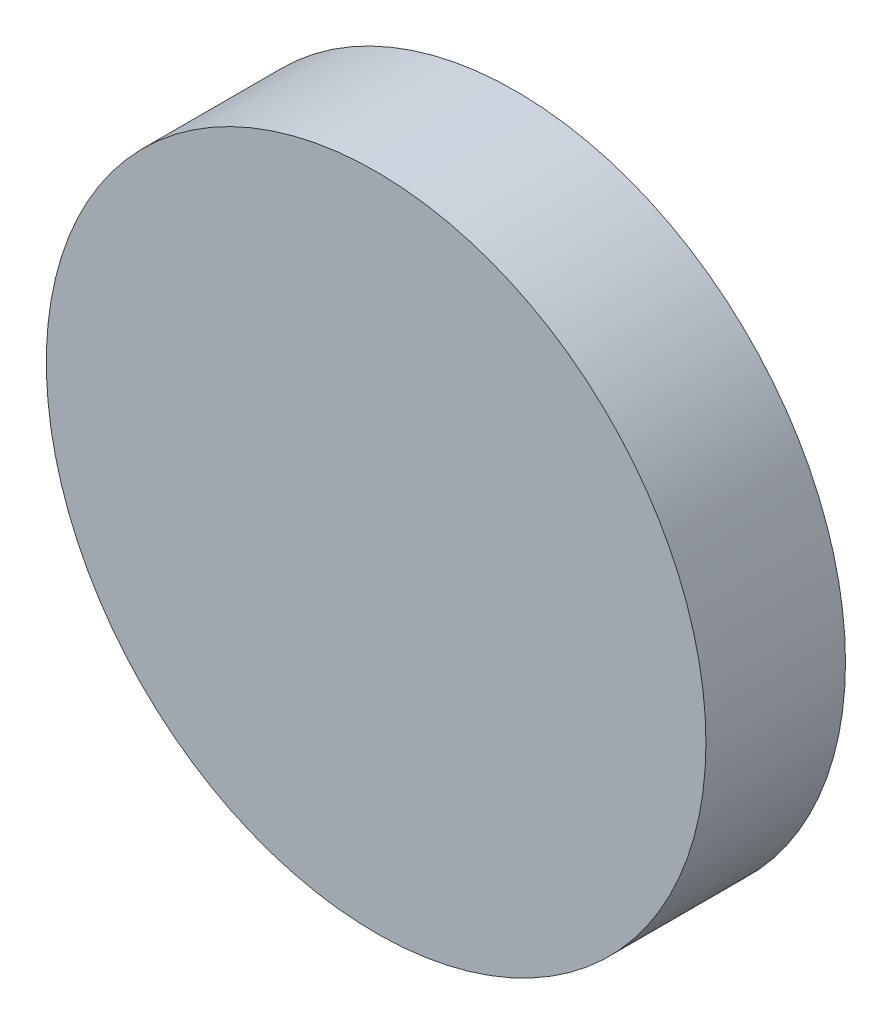
ISO-10303-21;
HEADER;
FILE_DESCRIPTION(('STEP AP214'),'2;1');
FILE_NAME('part.step','',(''),(''),'','','');
FILE_SCHEMA(('AUTOMOTIVE_DESIGN { 1 0 10303 214 1 1 1 1 }'));
ENDSEC;
DATA;
#1=APPLICATION_CONTEXT('core data for automotive mechanical design processes');
#2=APPLICATION_PROTOCOL_DEFINITION('international standard','automotive_design',2000,#1);
#3=PRODUCT_CONTEXT('',#1,'mechanical');
#4=PRODUCT('Part','Part','',(#3));
#5=PRODUCT_RELATED_PRODUCT_CATEGORY('part','',(#4));
#6=PRODUCT_DEFINITION_FORMATION('','',#4);
#7=PRODUCT_DEFINITION_CONTEXT('part definition',#1,'design');
#8=PRODUCT_DEFINITION('design','',#6,#7);
#9=PRODUCT_DEFINITION_SHAPE('','',#8);
#10=(LENGTH_UNIT() NAMED_UNIT(*) SI_UNIT(.MILLI.,.METRE.));
#11=(NAMED_UNIT(*) PLANE_ANGLE_UNIT() SI_UNIT($,.RADIAN.));
#12=(NAMED_UNIT(*) SI_UNIT($,.STERADIAN.) SOLID_ANGLE_UNIT());
#13=UNCERTAINTY_MEASURE_WITH_UNIT(LENGTH_MEASURE(1.E-05),#10,'distance_accuracy_value','');
#14=(GEOMETRIC_REPRESENTATION_CONTEXT(3) GLOBAL_UNCERTAINTY_ASSIGNED_CONTEXT((#13)) GLOBAL_UNIT_ASSIGNED_CONTEXT((#10,
#11,#12)) REPRESENTATION_CONTEXT('',''));
#15=CARTESIAN_POINT('',(0.,0.,0.));
#16=DIRECTION('',(0.,0.,1.));
#17=DIRECTION('',(1.,0.,0.));
#18=AXIS2_PLACEMENT_3D('',#15,#16,#17);
#19=CARTESIAN_POINT('',(0.,0.,11.));
#20=DIRECTION('',(0.,0.,-1.));
#21=DIRECTION('',(-1.,0.,0.));
#22=AXIS2_PLACEMENT_3D('',#19,#20,#21);
#23=CYLINDRICAL_SURFACE('',#22,26.);
#24=CARTESIAN_POINT('',(0.,0.,11.));
#25=DIRECTION('',(0.,0.,1.));
#26=DIRECTION('',(1.,0.,0.));
#27=AXIS2_PLACEMENT_3D('',#24,#25,#26);
#28=CIRCLE('',#27,26.);
#29=CARTESIAN_POINT('',(26.,0.,11.));
#30=VERTEX_POINT('',#29);
#31=EDGE_CURVE('E10',#30,#30,#28,.T.);
#32=ORIENTED_EDGE('',*,*,#31,.F.);
#33=EDGE_LOOP('',(#32));
#34=FACE_BOUND('',#33,.T.);
#35=CARTESIAN_POINT('',(0.,0.,0.));
#36=DIRECTION('',(0.,0.,1.));
#37=DIRECTION('',(1.,0.,0.));
#38=AXIS2_PLACEMENT_3D('',#35,#36,#37);
#39=CIRCLE('',#38,26.);
#40=CARTESIAN_POINT('',(26.,0.,0.));
#41=VERTEX_POINT('',#40);
#42=EDGE_CURVE('E40',#41,#41,#39,.T.);
#43=ORIENTED_EDGE('',*,*,#42,.T.);
#44=EDGE_LOOP('',(#43));
#45=FACE_BOUND('',#44,.T.);
#46=ADVANCED_FACE('F37',(#34,#45),#23,.T.);
#47=CARTESIAN_POINT('',(0.,0.,11.));
#48=DIRECTION('',(0.,0.,1.));
#49=DIRECTION('',(1.,0.,0.));
#50=AXIS2_PLACEMENT_3D('',#47,#48,#49);
#51=PLANE('',#50);
#52=ORIENTED_EDGE('',*,*,#31,.T.);
#53=EDGE_LOOP('',(#52));
#54=FACE_BOUND('',#53,.T.);
#55=ADVANCED_FACE('F54',(#54),#51,.T.);
#56=CARTESIAN_POINT('',(0.,0.,0.));
#57=DIRECTION('',(0.,0.,1.));
#58=DIRECTION('',(1.,0.,0.));
#59=AXIS2_PLACEMENT_3D('',#56,#57,#58);
#60=PLANE('',#59);
#61=ORIENTED_EDGE('',*,*,#42,.F.);
#62=EDGE_LOOP('',(#61));
#63=FACE_BOUND('',#62,.T.);
#64=ADVANCED_FACE('F52',(#63),#60,.F.);
#65=CLOSED_SHELL('',(#46,#55,#64));
#66=MANIFOLD_SOLID_BREP('B2',#65);
#67=ADVANCED_BREP_SHAPE_REPRESENTATION('',(#18,#66),#14);
#68=SHAPE_DEFINITION_REPRESENTATION(#9,#67);
ENDSEC;
END-ISO-10303-21;
